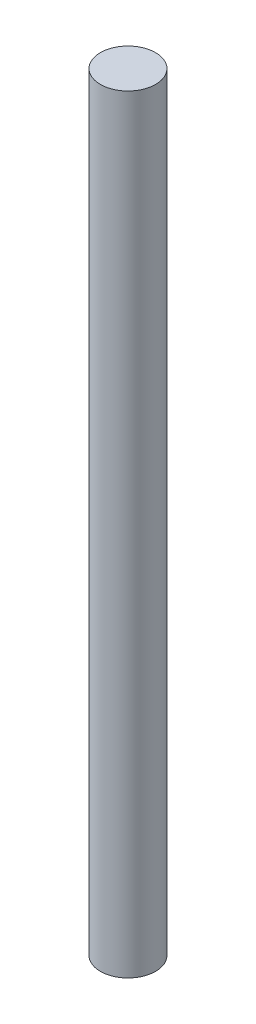
ISO-10303-21;
HEADER;
FILE_DESCRIPTION(('STEP AP214'),'2;1');
FILE_NAME('part.step','',(''),(''),'','','');
FILE_SCHEMA(('AUTOMOTIVE_DESIGN { 1 0 10303 214 1 1 1 1 }'));
ENDSEC;
DATA;
#1=APPLICATION_CONTEXT('core data for automotive mechanical design processes');
#2=APPLICATION_PROTOCOL_DEFINITION('international standard','automotive_design',2000,#1);
#3=PRODUCT_CONTEXT('',#1,'mechanical');
#4=PRODUCT('Part','Part','',(#3));
#5=PRODUCT_RELATED_PRODUCT_CATEGORY('part','',(#4));
#6=PRODUCT_DEFINITION_FORMATION('','',#4);
#7=PRODUCT_DEFINITION_CONTEXT('part definition',#1,'design');
#8=PRODUCT_DEFINITION('design','',#6,#7);
#9=PRODUCT_DEFINITION_SHAPE('','',#8);
#10=(LENGTH_UNIT() NAMED_UNIT(*) SI_UNIT(.MILLI.,.METRE.));
#11=(NAMED_UNIT(*) PLANE_ANGLE_UNIT() SI_UNIT($,.RADIAN.));
#12=(NAMED_UNIT(*) SI_UNIT($,.STERADIAN.) SOLID_ANGLE_UNIT());
#13=UNCERTAINTY_MEASURE_WITH_UNIT(LENGTH_MEASURE(1.E-05),#10,'distance_accuracy_value','');
#14=(GEOMETRIC_REPRESENTATION_CONTEXT(3) GLOBAL_UNCERTAINTY_ASSIGNED_CONTEXT((#13)) GLOBAL_UNIT_ASSIGNED_CONTEXT((#10,
#11,#12)) REPRESENTATION_CONTEXT('',''));
#15=CARTESIAN_POINT('',(0.,0.,0.));
#16=DIRECTION('',(0.,0.,1.));
#17=DIRECTION('',(1.,0.,0.));
#18=AXIS2_PLACEMENT_3D('',#15,#16,#17);
#19=CARTESIAN_POINT('',(0.,55.7,0.));
#20=DIRECTION('',(0.,-1.,0.));
#21=DIRECTION('',(0.,0.,-1.));
#22=AXIS2_PLACEMENT_3D('',#19,#20,#21);
#23=CYLINDRICAL_SURFACE('',#22,4.);
#24=CARTESIAN_POINT('',(0.,55.7,0.));
#25=DIRECTION('',(0.,1.,0.));
#26=DIRECTION('',(0.,0.,1.));
#27=AXIS2_PLACEMENT_3D('',#24,#25,#26);
#28=CIRCLE('',#27,4.);
#29=CARTESIAN_POINT('',(0.,55.7,4.));
#30=VERTEX_POINT('',#29);
#31=EDGE_CURVE('E10',#30,#30,#28,.T.);
#32=ORIENTED_EDGE('',*,*,#31,.F.);
#33=EDGE_LOOP('',(#32));
#34=FACE_BOUND('',#33,.T.);
#35=CARTESIAN_POINT('',(0.,-55.7,0.));
#36=DIRECTION('',(0.,1.,0.));
#37=DIRECTION('',(0.,0.,1.));
#38=AXIS2_PLACEMENT_3D('',#35,#36,#37);
#39=CIRCLE('',#38,4.);
#40=CARTESIAN_POINT('',(0.,-55.7,4.));
#41=VERTEX_POINT('',#40);
#42=EDGE_CURVE('E35',#41,#41,#39,.T.);
#43=ORIENTED_EDGE('',*,*,#42,.T.);
#44=EDGE_LOOP('',(#43));
#45=FACE_BOUND('',#44,.T.);
#46=ADVANCED_FACE('F32',(#34,#45),#23,.T.);
#47=CARTESIAN_POINT('',(0.,55.7,0.));
#48=DIRECTION('',(0.,1.,0.));
#49=DIRECTION('',(0.,0.,1.));
#50=AXIS2_PLACEMENT_3D('',#47,#48,#49);
#51=PLANE('',#50);
#52=ORIENTED_EDGE('',*,*,#31,.T.);
#53=EDGE_LOOP('',(#52));
#54=FACE_BOUND('',#53,.T.);
#55=ADVANCED_FACE('F47',(#54),#51,.T.);
#56=CARTESIAN_POINT('',(0.,-55.7,0.));
#57=DIRECTION('',(0.,1.,0.));
#58=DIRECTION('',(0.,0.,1.));
#59=AXIS2_PLACEMENT_3D('',#56,#57,#58);
#60=PLANE('',#59);
#61=ORIENTED_EDGE('',*,*,#42,.F.);
#62=EDGE_LOOP('',(#61));
#63=FACE_BOUND('',#62,.T.);
#64=ADVANCED_FACE('F45',(#63),#60,.F.);
#65=CLOSED_SHELL('',(#46,#55,#64));
#66=MANIFOLD_SOLID_BREP('B2',#65);
#67=ADVANCED_BREP_SHAPE_REPRESENTATION('',(#18,#66),#14);
#68=SHAPE_DEFINITION_REPRESENTATION(#9,#67);
ENDSEC;
END-ISO-10303-21;
